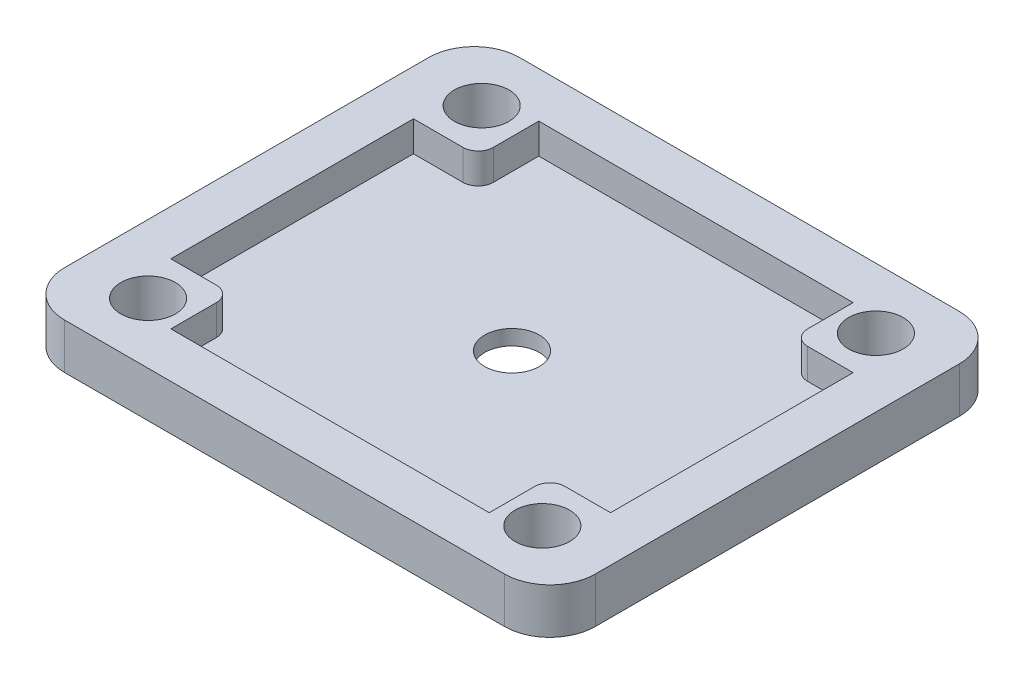
ISO-10303-21;
HEADER;
FILE_DESCRIPTION(('STEP AP214'),'2;1');
FILE_NAME('part.step','',(''),(''),'','','');
FILE_SCHEMA(('AUTOMOTIVE_DESIGN { 1 0 10303 214 1 1 1 1 }'));
ENDSEC;
DATA;
#1=APPLICATION_CONTEXT('core data for automotive mechanical design processes');
#2=APPLICATION_PROTOCOL_DEFINITION('international standard','automotive_design',2000,#1);
#3=PRODUCT_CONTEXT('',#1,'mechanical');
#4=PRODUCT('Part','Part','',(#3));
#5=PRODUCT_RELATED_PRODUCT_CATEGORY('part','',(#4));
#6=PRODUCT_DEFINITION_FORMATION('','',#4);
#7=PRODUCT_DEFINITION_CONTEXT('part definition',#1,'design');
#8=PRODUCT_DEFINITION('design','',#6,#7);
#9=PRODUCT_DEFINITION_SHAPE('','',#8);
#10=(LENGTH_UNIT() NAMED_UNIT(*) SI_UNIT(.MILLI.,.METRE.));
#11=(NAMED_UNIT(*) PLANE_ANGLE_UNIT() SI_UNIT($,.RADIAN.));
#12=(NAMED_UNIT(*) SI_UNIT($,.STERADIAN.) SOLID_ANGLE_UNIT());
#13=UNCERTAINTY_MEASURE_WITH_UNIT(LENGTH_MEASURE(1.E-05),#10,'distance_accuracy_value','');
#14=(GEOMETRIC_REPRESENTATION_CONTEXT(3) GLOBAL_UNCERTAINTY_ASSIGNED_CONTEXT((#13)) GLOBAL_UNIT_ASSIGNED_CONTEXT((#10,
#11,#12)) REPRESENTATION_CONTEXT('',''));
#15=CARTESIAN_POINT('',(0.,0.,0.));
#16=DIRECTION('',(0.,0.,1.));
#17=DIRECTION('',(1.,0.,0.));
#18=AXIS2_PLACEMENT_3D('',#15,#16,#17);
#19=CARTESIAN_POINT('',(0.,3.,0.));
#20=DIRECTION('',(0.,-1.,0.));
#21=DIRECTION('',(0.,0.,-1.));
#22=AXIS2_PLACEMENT_3D('',#19,#20,#21);
#23=PLANE('',#22);
#24=CARTESIAN_POINT('',(13.,3.,-11.));
#25=DIRECTION('',(0.,1.,0.));
#26=DIRECTION('',(0.,0.,1.));
#27=AXIS2_PLACEMENT_3D('',#24,#25,#26);
#28=CIRCLE('',#27,1.79999999999999);
#29=CARTESIAN_POINT('',(13.,3.,-9.20000000000001));
#30=VERTEX_POINT('',#29);
#31=EDGE_CURVE('E752',#30,#30,#28,.T.);
#32=ORIENTED_EDGE('',*,*,#31,.F.);
#33=EDGE_LOOP('',(#32));
#34=FACE_BOUND('',#33,.T.);
#35=CARTESIAN_POINT('',(-13.,3.,11.));
#36=DIRECTION('',(0.,1.,0.));
#37=DIRECTION('',(0.,0.,1.));
#38=AXIS2_PLACEMENT_3D('',#35,#36,#37);
#39=CIRCLE('',#38,1.79999999999999);
#40=CARTESIAN_POINT('',(-13.,3.,12.8));
#41=VERTEX_POINT('',#40);
#42=EDGE_CURVE('E746',#41,#41,#39,.T.);
#43=ORIENTED_EDGE('',*,*,#42,.F.);
#44=EDGE_LOOP('',(#43));
#45=FACE_BOUND('',#44,.T.);
#46=CARTESIAN_POINT('',(-13.,3.,-11.));
#47=DIRECTION('',(0.,1.,0.));
#48=DIRECTION('',(0.,0.,1.));
#49=AXIS2_PLACEMENT_3D('',#46,#47,#48);
#50=CIRCLE('',#49,1.79999999999999);
#51=CARTESIAN_POINT('',(-13.,3.,-9.20000000000001));
#52=VERTEX_POINT('',#51);
#53=EDGE_CURVE('E738',#52,#52,#50,.T.);
#54=ORIENTED_EDGE('',*,*,#53,.F.);
#55=EDGE_LOOP('',(#54));
#56=FACE_BOUND('',#55,.T.);
#57=DIRECTION('',(0.,0.,-1.));
#58=VECTOR('',#57,1.);
#59=CARTESIAN_POINT('',(-10.5,3.,12.));
#60=LINE('',#59,#58);
#61=CARTESIAN_POINT('',(-10.5,3.,12.));
#62=VERTEX_POINT('',#61);
#63=CARTESIAN_POINT('',(-10.5,3.,9.));
#64=VERTEX_POINT('',#63);
#65=EDGE_CURVE('E202',#62,#64,#60,.T.);
#66=ORIENTED_EDGE('',*,*,#65,.T.);
#67=CARTESIAN_POINT('',(-11.5,3.,9.));
#68=DIRECTION('',(0.,-1.,0.));
#69=DIRECTION('',(0.,0.,-1.));
#70=AXIS2_PLACEMENT_3D('',#67,#68,#69);
#71=CIRCLE('',#70,1.);
#72=CARTESIAN_POINT('',(-11.5,3.,8.));
#73=VERTEX_POINT('',#72);
#74=EDGE_CURVE('E369',#64,#73,#71,.F.);
#75=ORIENTED_EDGE('',*,*,#74,.T.);
#76=DIRECTION('',(-1.,0.,0.));
#77=VECTOR('',#76,1.);
#78=CARTESIAN_POINT('',(-14.5,3.,8.00000000000001));
#79=LINE('',#78,#77);
#80=CARTESIAN_POINT('',(-14.5,3.,8.));
#81=VERTEX_POINT('',#80);
#82=EDGE_CURVE('E226',#73,#81,#79,.T.);
#83=ORIENTED_EDGE('',*,*,#82,.T.);
#84=DIRECTION('',(0.,0.,1.));
#85=VECTOR('',#84,1.);
#86=CARTESIAN_POINT('',(-14.5,3.,-12.));
#87=LINE('',#86,#85);
#88=CARTESIAN_POINT('',(-14.5,3.,-7.99999999999999));
#89=VERTEX_POINT('',#88);
#90=EDGE_CURVE('E283',#89,#81,#87,.T.);
#91=ORIENTED_EDGE('',*,*,#90,.F.);
#92=DIRECTION('',(1.,0.,0.));
#93=VECTOR('',#92,1.);
#94=CARTESIAN_POINT('',(-14.5,3.,-7.99999999999999));
#95=LINE('',#94,#93);
#96=CARTESIAN_POINT('',(-11.2337449665981,3.,-7.99999999999999));
#97=VERTEX_POINT('',#96);
#98=EDGE_CURVE('E269',#89,#97,#95,.T.);
#99=ORIENTED_EDGE('',*,*,#98,.T.);
#100=CARTESIAN_POINT('',(-11.2337449665981,3.,-8.99999999999999));
#101=DIRECTION('',(0.,-1.,0.));
#102=DIRECTION('',(0.,0.,-1.));
#103=AXIS2_PLACEMENT_3D('',#100,#101,#102);
#104=CIRCLE('',#103,1.);
#105=CARTESIAN_POINT('',(-10.2337449665981,3.,-8.99999999999999));
#106=VERTEX_POINT('',#105);
#107=EDGE_CURVE('E363',#97,#106,#104,.F.);
#108=ORIENTED_EDGE('',*,*,#107,.T.);
#109=DIRECTION('',(0.,0.,-1.));
#110=VECTOR('',#109,1.);
#111=CARTESIAN_POINT('',(-10.2337449665981,3.,-12.));
#112=LINE('',#111,#110);
#113=CARTESIAN_POINT('',(-10.2337449665981,3.,-12.));
#114=VERTEX_POINT('',#113);
#115=EDGE_CURVE('E272',#106,#114,#112,.T.);
#116=ORIENTED_EDGE('',*,*,#115,.T.);
#117=DIRECTION('',(-1.,0.,0.));
#118=VECTOR('',#117,1.);
#119=CARTESIAN_POINT('',(14.5,3.,-12.));
#120=LINE('',#119,#118);
#121=CARTESIAN_POINT('',(10.5,3.,-12.));
#122=VERTEX_POINT('',#121);
#123=EDGE_CURVE('E295',#122,#114,#120,.T.);
#124=ORIENTED_EDGE('',*,*,#123,.F.);
#125=DIRECTION('',(0.,0.,1.));
#126=VECTOR('',#125,1.);
#127=CARTESIAN_POINT('',(10.5,3.,-12.));
#128=LINE('',#127,#126);
#129=CARTESIAN_POINT('',(10.5,3.,-9.));
#130=VERTEX_POINT('',#129);
#131=EDGE_CURVE('E253',#122,#130,#128,.T.);
#132=ORIENTED_EDGE('',*,*,#131,.T.);
#133=CARTESIAN_POINT('',(11.5,3.,-9.));
#134=DIRECTION('',(0.,-1.,0.));
#135=DIRECTION('',(0.,0.,-1.));
#136=AXIS2_PLACEMENT_3D('',#133,#134,#135);
#137=CIRCLE('',#136,1.);
#138=CARTESIAN_POINT('',(11.5,3.,-8.));
#139=VERTEX_POINT('',#138);
#140=EDGE_CURVE('E365',#130,#139,#137,.F.);
#141=ORIENTED_EDGE('',*,*,#140,.T.);
#142=DIRECTION('',(1.,0.,0.));
#143=VECTOR('',#142,1.);
#144=CARTESIAN_POINT('',(14.5,3.,-8.));
#145=LINE('',#144,#143);
#146=CARTESIAN_POINT('',(14.5,3.,-8.));
#147=VERTEX_POINT('',#146);
#148=EDGE_CURVE('E256',#139,#147,#145,.T.);
#149=ORIENTED_EDGE('',*,*,#148,.T.);
#150=DIRECTION('',(0.,0.,-1.));
#151=VECTOR('',#150,1.);
#152=CARTESIAN_POINT('',(14.5,3.,12.));
#153=LINE('',#152,#151);
#154=CARTESIAN_POINT('',(14.5,3.,8.));
#155=VERTEX_POINT('',#154);
#156=EDGE_CURVE('E209',#155,#147,#153,.T.);
#157=ORIENTED_EDGE('',*,*,#156,.F.);
#158=DIRECTION('',(-1.,0.,0.));
#159=VECTOR('',#158,1.);
#160=CARTESIAN_POINT('',(14.5,3.,8.));
#161=LINE('',#160,#159);
#162=CARTESIAN_POINT('',(11.5,3.,8.));
#163=VERTEX_POINT('',#162);
#164=EDGE_CURVE('E239',#155,#163,#161,.T.);
#165=ORIENTED_EDGE('',*,*,#164,.T.);
#166=CARTESIAN_POINT('',(11.5,3.,9.));
#167=DIRECTION('',(0.,-1.,0.));
#168=DIRECTION('',(0.,0.,-1.));
#169=AXIS2_PLACEMENT_3D('',#166,#167,#168);
#170=CIRCLE('',#169,1.);
#171=CARTESIAN_POINT('',(10.5,3.,9.));
#172=VERTEX_POINT('',#171);
#173=EDGE_CURVE('E367',#163,#172,#170,.F.);
#174=ORIENTED_EDGE('',*,*,#173,.T.);
#175=DIRECTION('',(0.,0.,1.));
#176=VECTOR('',#175,1.);
#177=CARTESIAN_POINT('',(10.5,3.,12.));
#178=LINE('',#177,#176);
#179=CARTESIAN_POINT('',(10.5,3.,12.));
#180=VERTEX_POINT('',#179);
#181=EDGE_CURVE('E205',#172,#180,#178,.T.);
#182=ORIENTED_EDGE('',*,*,#181,.T.);
#183=DIRECTION('',(1.,0.,0.));
#184=VECTOR('',#183,1.);
#185=CARTESIAN_POINT('',(-14.5,3.,12.));
#186=LINE('',#185,#184);
#187=EDGE_CURVE('E198',#62,#180,#186,.T.);
#188=ORIENTED_EDGE('',*,*,#187,.F.);
#189=EDGE_LOOP('',(#66,#75,#83,#91,#99,#108,#116,#124,#132,#141,#149,#157,#165,#174,#182,#188));
#190=FACE_BOUND('',#189,.T.);
#191=DIRECTION('',(1.,0.,0.));
#192=VECTOR('',#191,1.);
#193=CARTESIAN_POINT('',(-17.5,3.,15.));
#194=LINE('',#193,#192);
#195=CARTESIAN_POINT('',(-14.5,3.,15.));
#196=VERTEX_POINT('',#195);
#197=CARTESIAN_POINT('',(14.5,3.,15.));
#198=VERTEX_POINT('',#197);
#199=EDGE_CURVE('E310',#196,#198,#194,.T.);
#200=ORIENTED_EDGE('',*,*,#199,.T.);
#201=CARTESIAN_POINT('',(14.5,3.,12.));
#202=DIRECTION('',(0.,-1.,0.));
#203=DIRECTION('',(0.,0.,-1.));
#204=AXIS2_PLACEMENT_3D('',#201,#202,#203);
#205=CIRCLE('',#204,3.);
#206=CARTESIAN_POINT('',(17.5,3.,12.));
#207=VERTEX_POINT('',#206);
#208=EDGE_CURVE('E347',#198,#207,#205,.F.);
#209=ORIENTED_EDGE('',*,*,#208,.T.);
#210=DIRECTION('',(0.,0.,-1.));
#211=VECTOR('',#210,1.);
#212=CARTESIAN_POINT('',(17.5,3.,15.));
#213=LINE('',#212,#211);
#214=CARTESIAN_POINT('',(17.5,3.,-12.));
#215=VERTEX_POINT('',#214);
#216=EDGE_CURVE('E300',#207,#215,#213,.T.);
#217=ORIENTED_EDGE('',*,*,#216,.T.);
#218=CARTESIAN_POINT('',(14.5,3.,-12.));
#219=DIRECTION('',(0.,-1.,0.));
#220=DIRECTION('',(0.,0.,-1.));
#221=AXIS2_PLACEMENT_3D('',#218,#219,#220);
#222=CIRCLE('',#221,3.);
#223=CARTESIAN_POINT('',(14.5,3.,-15.));
#224=VERTEX_POINT('',#223);
#225=EDGE_CURVE('E341',#215,#224,#222,.F.);
#226=ORIENTED_EDGE('',*,*,#225,.T.);
#227=DIRECTION('',(-1.,0.,0.));
#228=VECTOR('',#227,1.);
#229=CARTESIAN_POINT('',(-17.5,3.,-15.));
#230=LINE('',#229,#228);
#231=CARTESIAN_POINT('',(-14.5,3.,-15.));
#232=VERTEX_POINT('',#231);
#233=EDGE_CURVE('E303',#224,#232,#230,.T.);
#234=ORIENTED_EDGE('',*,*,#233,.T.);
#235=CARTESIAN_POINT('',(-14.5,3.,-12.));
#236=DIRECTION('',(0.,-1.,0.));
#237=DIRECTION('',(0.,0.,-1.));
#238=AXIS2_PLACEMENT_3D('',#235,#236,#237);
#239=CIRCLE('',#238,3.);
#240=CARTESIAN_POINT('',(-17.5,3.,-12.));
#241=VERTEX_POINT('',#240);
#242=EDGE_CURVE('E343',#232,#241,#239,.F.);
#243=ORIENTED_EDGE('',*,*,#242,.T.);
#244=DIRECTION('',(0.,0.,1.));
#245=VECTOR('',#244,1.);
#246=CARTESIAN_POINT('',(-17.5,3.,15.));
#247=LINE('',#246,#245);
#248=CARTESIAN_POINT('',(-17.5,3.,12.));
#249=VERTEX_POINT('',#248);
#250=EDGE_CURVE('E307',#241,#249,#247,.T.);
#251=ORIENTED_EDGE('',*,*,#250,.T.);
#252=CARTESIAN_POINT('',(-14.5,3.,12.));
#253=DIRECTION('',(0.,-1.,0.));
#254=DIRECTION('',(0.,0.,-1.));
#255=AXIS2_PLACEMENT_3D('',#252,#253,#254);
#256=CIRCLE('',#255,3.);
#257=EDGE_CURVE('E345',#249,#196,#256,.F.);
#258=ORIENTED_EDGE('',*,*,#257,.T.);
#259=EDGE_LOOP('',(#200,#209,#217,#226,#234,#243,#251,#258));
#260=FACE_BOUND('',#259,.T.);
#261=CARTESIAN_POINT('',(13.,3.,11.));
#262=DIRECTION('',(0.,1.,0.));
#263=DIRECTION('',(0.,0.,1.));
#264=AXIS2_PLACEMENT_3D('',#261,#262,#263);
#265=CIRCLE('',#264,1.79999999999999);
#266=CARTESIAN_POINT('',(13.,3.,12.8));
#267=VERTEX_POINT('',#266);
#268=EDGE_CURVE('E734',#267,#267,#265,.T.);
#269=ORIENTED_EDGE('',*,*,#268,.F.);
#270=EDGE_LOOP('',(#269));
#271=FACE_BOUND('',#270,.T.);
#272=ADVANCED_FACE('F38',(#34,#45,#56,#190,#260,#271),#23,.F.);
#273=CARTESIAN_POINT('',(0.,1.,0.));
#274=DIRECTION('',(0.,1.,0.));
#275=DIRECTION('',(0.,0.,1.));
#276=AXIS2_PLACEMENT_3D('',#273,#274,#275);
#277=PLANE('',#276);
#278=CARTESIAN_POINT('',(0.,1.,0.));
#279=DIRECTION('',(0.,1.,0.));
#280=DIRECTION('',(0.,0.,1.));
#281=AXIS2_PLACEMENT_3D('',#278,#279,#280);
#282=CIRCLE('',#281,1.79999999999999);
#283=CARTESIAN_POINT('',(0.,1.,1.79999999999999));
#284=VERTEX_POINT('',#283);
#285=EDGE_CURVE('E755',#284,#284,#282,.T.);
#286=ORIENTED_EDGE('',*,*,#285,.F.);
#287=EDGE_LOOP('',(#286));
#288=FACE_BOUND('',#287,.T.);
#289=DIRECTION('',(-1.,0.,0.));
#290=VECTOR('',#289,1.);
#291=CARTESIAN_POINT('',(-14.5,1.,8.00000000000001));
#292=LINE('',#291,#290);
#293=CARTESIAN_POINT('',(-11.5,1.,8.));
#294=VERTEX_POINT('',#293);
#295=CARTESIAN_POINT('',(-14.5,1.,8.));
#296=VERTEX_POINT('',#295);
#297=EDGE_CURVE('E227',#294,#296,#292,.T.);
#298=ORIENTED_EDGE('',*,*,#297,.F.);
#299=CARTESIAN_POINT('',(-11.5,1.,9.));
#300=DIRECTION('',(0.,1.,0.));
#301=DIRECTION('',(0.,0.,1.));
#302=AXIS2_PLACEMENT_3D('',#299,#300,#301);
#303=CIRCLE('',#302,1.);
#304=CARTESIAN_POINT('',(-10.5,1.,9.));
#305=VERTEX_POINT('',#304);
#306=EDGE_CURVE('E385',#294,#305,#303,.F.);
#307=ORIENTED_EDGE('',*,*,#306,.T.);
#308=DIRECTION('',(0.,0.,-1.));
#309=VECTOR('',#308,1.);
#310=CARTESIAN_POINT('',(-10.5,1.,12.));
#311=LINE('',#310,#309);
#312=CARTESIAN_POINT('',(-10.5,1.,12.));
#313=VERTEX_POINT('',#312);
#314=EDGE_CURVE('E230',#313,#305,#311,.T.);
#315=ORIENTED_EDGE('',*,*,#314,.F.);
#316=DIRECTION('',(1.,0.,0.));
#317=VECTOR('',#316,1.);
#318=CARTESIAN_POINT('',(-14.5,1.,12.));
#319=LINE('',#318,#317);
#320=CARTESIAN_POINT('',(10.5,1.,12.));
#321=VERTEX_POINT('',#320);
#322=EDGE_CURVE('E217',#313,#321,#319,.T.);
#323=ORIENTED_EDGE('',*,*,#322,.T.);
#324=DIRECTION('',(0.,0.,1.));
#325=VECTOR('',#324,1.);
#326=CARTESIAN_POINT('',(10.5,1.,12.));
#327=LINE('',#326,#325);
#328=CARTESIAN_POINT('',(10.5,1.,9.));
#329=VERTEX_POINT('',#328);
#330=EDGE_CURVE('E242',#329,#321,#327,.T.);
#331=ORIENTED_EDGE('',*,*,#330,.F.);
#332=CARTESIAN_POINT('',(11.5,1.,9.));
#333=DIRECTION('',(0.,1.,0.));
#334=DIRECTION('',(0.,0.,1.));
#335=AXIS2_PLACEMENT_3D('',#332,#333,#334);
#336=CIRCLE('',#335,1.);
#337=CARTESIAN_POINT('',(11.5,1.,8.));
#338=VERTEX_POINT('',#337);
#339=EDGE_CURVE('E387',#329,#338,#336,.F.);
#340=ORIENTED_EDGE('',*,*,#339,.T.);
#341=DIRECTION('',(-1.,0.,0.));
#342=VECTOR('',#341,1.);
#343=CARTESIAN_POINT('',(14.5,1.,8.));
#344=LINE('',#343,#342);
#345=CARTESIAN_POINT('',(14.5,1.,8.));
#346=VERTEX_POINT('',#345);
#347=EDGE_CURVE('E220',#346,#338,#344,.T.);
#348=ORIENTED_EDGE('',*,*,#347,.F.);
#349=DIRECTION('',(0.,0.,-1.));
#350=VECTOR('',#349,1.);
#351=CARTESIAN_POINT('',(14.5,1.,12.));
#352=LINE('',#351,#350);
#353=CARTESIAN_POINT('',(14.5,1.,-8.));
#354=VERTEX_POINT('',#353);
#355=EDGE_CURVE('E282',#346,#354,#352,.T.);
#356=ORIENTED_EDGE('',*,*,#355,.T.);
#357=DIRECTION('',(1.,0.,0.));
#358=VECTOR('',#357,1.);
#359=CARTESIAN_POINT('',(14.5,1.,-8.));
#360=LINE('',#359,#358);
#361=CARTESIAN_POINT('',(11.5,1.,-8.));
#362=VERTEX_POINT('',#361);
#363=EDGE_CURVE('E257',#362,#354,#360,.T.);
#364=ORIENTED_EDGE('',*,*,#363,.F.);
#365=CARTESIAN_POINT('',(11.5,1.,-9.));
#366=DIRECTION('',(0.,1.,0.));
#367=DIRECTION('',(0.,0.,1.));
#368=AXIS2_PLACEMENT_3D('',#365,#366,#367);
#369=CIRCLE('',#368,1.);
#370=CARTESIAN_POINT('',(10.5,1.,-9.));
#371=VERTEX_POINT('',#370);
#372=EDGE_CURVE('E46',#362,#371,#369,.F.);
#373=ORIENTED_EDGE('',*,*,#372,.T.);
#374=DIRECTION('',(0.,0.,1.));
#375=VECTOR('',#374,1.);
#376=CARTESIAN_POINT('',(10.5,1.,-12.));
#377=LINE('',#376,#375);
#378=CARTESIAN_POINT('',(10.5,1.,-12.));
#379=VERTEX_POINT('',#378);
#380=EDGE_CURVE('E252',#379,#371,#377,.T.);
#381=ORIENTED_EDGE('',*,*,#380,.F.);
#382=DIRECTION('',(-1.,0.,0.));
#383=VECTOR('',#382,1.);
#384=CARTESIAN_POINT('',(14.5,1.,-12.));
#385=LINE('',#384,#383);
#386=CARTESIAN_POINT('',(-10.2337449665981,1.,-12.));
#387=VERTEX_POINT('',#386);
#388=EDGE_CURVE('E286',#379,#387,#385,.T.);
#389=ORIENTED_EDGE('',*,*,#388,.T.);
#390=DIRECTION('',(0.,0.,-1.));
#391=VECTOR('',#390,1.);
#392=CARTESIAN_POINT('',(-10.2337449665981,1.,-12.));
#393=LINE('',#392,#391);
#394=CARTESIAN_POINT('',(-10.2337449665981,1.,-8.99999999999999));
#395=VERTEX_POINT('',#394);
#396=EDGE_CURVE('E273',#395,#387,#393,.T.);
#397=ORIENTED_EDGE('',*,*,#396,.F.);
#398=CARTESIAN_POINT('',(-11.2337449665981,1.,-8.99999999999999));
#399=DIRECTION('',(0.,1.,0.));
#400=DIRECTION('',(0.,0.,1.));
#401=AXIS2_PLACEMENT_3D('',#398,#399,#400);
#402=CIRCLE('',#401,1.);
#403=CARTESIAN_POINT('',(-11.2337449665981,1.,-7.99999999999999));
#404=VERTEX_POINT('',#403);
#405=EDGE_CURVE('E11',#395,#404,#402,.F.);
#406=ORIENTED_EDGE('',*,*,#405,.T.);
#407=DIRECTION('',(1.,0.,0.));
#408=VECTOR('',#407,1.);
#409=CARTESIAN_POINT('',(-14.5,1.,-7.99999999999999));
#410=LINE('',#409,#408);
#411=CARTESIAN_POINT('',(-14.5,1.,-7.99999999999999));
#412=VERTEX_POINT('',#411);
#413=EDGE_CURVE('E268',#412,#404,#410,.T.);
#414=ORIENTED_EDGE('',*,*,#413,.F.);
#415=DIRECTION('',(0.,0.,1.));
#416=VECTOR('',#415,1.);
#417=CARTESIAN_POINT('',(-14.5,1.,-12.));
#418=LINE('',#417,#416);
#419=EDGE_CURVE('E289',#412,#296,#418,.T.);
#420=ORIENTED_EDGE('',*,*,#419,.T.);
#421=EDGE_LOOP('',(#298,#307,#315,#323,#331,#340,#348,#356,#364,#373,#381,#389,#397,#406,#414,#420));
#422=FACE_BOUND('',#421,.T.);
#423=ADVANCED_FACE('F390',(#288,#422),#277,.T.);
#424=CARTESIAN_POINT('',(-14.5,1.,12.));
#425=DIRECTION('',(0.,0.,1.));
#426=DIRECTION('',(1.,0.,0.));
#427=AXIS2_PLACEMENT_3D('',#424,#425,#426);
#428=PLANE('',#427);
#429=DIRECTION('',(0.,-1.,0.));
#430=VECTOR('',#429,1.);
#431=CARTESIAN_POINT('',(-10.5,3.,12.));
#432=LINE('',#431,#430);
#433=EDGE_CURVE('E214',#62,#313,#432,.T.);
#434=ORIENTED_EDGE('',*,*,#433,.F.);
#435=ORIENTED_EDGE('',*,*,#187,.T.);
#436=DIRECTION('',(0.,-1.,0.));
#437=VECTOR('',#436,1.);
#438=CARTESIAN_POINT('',(10.5,3.,12.));
#439=LINE('',#438,#437);
#440=EDGE_CURVE('E244',#180,#321,#439,.T.);
#441=ORIENTED_EDGE('',*,*,#440,.T.);
#442=ORIENTED_EDGE('',*,*,#322,.F.);
#443=EDGE_LOOP('',(#434,#435,#441,#442));
#444=FACE_BOUND('',#443,.T.);
#445=ADVANCED_FACE('F215',(#444),#428,.F.);
#446=CARTESIAN_POINT('',(-14.5,1.,-12.));
#447=DIRECTION('',(-1.,0.,0.));
#448=DIRECTION('',(0.,0.,1.));
#449=AXIS2_PLACEMENT_3D('',#446,#447,#448);
#450=PLANE('',#449);
#451=DIRECTION('',(0.,-1.,0.));
#452=VECTOR('',#451,1.);
#453=CARTESIAN_POINT('',(-14.5,3.,8.00000000000001));
#454=LINE('',#453,#452);
#455=EDGE_CURVE('E221',#81,#296,#454,.T.);
#456=ORIENTED_EDGE('',*,*,#455,.T.);
#457=ORIENTED_EDGE('',*,*,#419,.F.);
#458=DIRECTION('',(0.,-1.,0.));
#459=VECTOR('',#458,1.);
#460=CARTESIAN_POINT('',(-14.5,3.,-7.99999999999999));
#461=LINE('',#460,#459);
#462=EDGE_CURVE('E210',#89,#412,#461,.T.);
#463=ORIENTED_EDGE('',*,*,#462,.F.);
#464=ORIENTED_EDGE('',*,*,#90,.T.);
#465=EDGE_LOOP('',(#456,#457,#463,#464));
#466=FACE_BOUND('',#465,.T.);
#467=ADVANCED_FACE('F430',(#466),#450,.F.);
#468=CARTESIAN_POINT('',(14.5,1.,12.));
#469=DIRECTION('',(1.,0.,0.));
#470=DIRECTION('',(0.,0.,-1.));
#471=AXIS2_PLACEMENT_3D('',#468,#469,#470);
#472=PLANE('',#471);
#473=DIRECTION('',(0.,-1.,0.));
#474=VECTOR('',#473,1.);
#475=CARTESIAN_POINT('',(14.5,3.,8.));
#476=LINE('',#475,#474);
#477=EDGE_CURVE('E249',#155,#346,#476,.T.);
#478=ORIENTED_EDGE('',*,*,#477,.F.);
#479=ORIENTED_EDGE('',*,*,#156,.T.);
#480=DIRECTION('',(0.,-1.,0.));
#481=VECTOR('',#480,1.);
#482=CARTESIAN_POINT('',(14.5,3.,-8.));
#483=LINE('',#482,#481);
#484=EDGE_CURVE('E259',#147,#354,#483,.T.);
#485=ORIENTED_EDGE('',*,*,#484,.T.);
#486=ORIENTED_EDGE('',*,*,#355,.F.);
#487=EDGE_LOOP('',(#478,#479,#485,#486));
#488=FACE_BOUND('',#487,.T.);
#489=ADVANCED_FACE('F408',(#488),#472,.F.);
#490=CARTESIAN_POINT('',(14.5,1.,-12.));
#491=DIRECTION('',(0.,0.,-1.));
#492=DIRECTION('',(-1.,0.,0.));
#493=AXIS2_PLACEMENT_3D('',#490,#491,#492);
#494=PLANE('',#493);
#495=DIRECTION('',(0.,-1.,0.));
#496=VECTOR('',#495,1.);
#497=CARTESIAN_POINT('',(10.5,3.,-12.));
#498=LINE('',#497,#496);
#499=EDGE_CURVE('E265',#122,#379,#498,.T.);
#500=ORIENTED_EDGE('',*,*,#499,.F.);
#501=ORIENTED_EDGE('',*,*,#123,.T.);
#502=DIRECTION('',(0.,-1.,0.));
#503=VECTOR('',#502,1.);
#504=CARTESIAN_POINT('',(-10.2337449665981,3.,-12.));
#505=LINE('',#504,#503);
#506=EDGE_CURVE('E275',#114,#387,#505,.T.);
#507=ORIENTED_EDGE('',*,*,#506,.T.);
#508=ORIENTED_EDGE('',*,*,#388,.F.);
#509=EDGE_LOOP('',(#500,#501,#507,#508));
#510=FACE_BOUND('',#509,.T.);
#511=ADVANCED_FACE('F440',(#510),#494,.F.);
#512=CARTESIAN_POINT('',(17.5,3.,15.));
#513=DIRECTION('',(-1.,0.,0.));
#514=DIRECTION('',(0.,0.,1.));
#515=AXIS2_PLACEMENT_3D('',#512,#513,#514);
#516=PLANE('',#515);
#517=ORIENTED_EDGE('',*,*,#216,.F.);
#518=DIRECTION('',(0.,-1.,0.));
#519=VECTOR('',#518,1.);
#520=CARTESIAN_POINT('',(17.5,3.,12.));
#521=LINE('',#520,#519);
#522=CARTESIAN_POINT('',(17.5,0.,12.));
#523=VERTEX_POINT('',#522);
#524=EDGE_CURVE('E325',#207,#523,#521,.T.);
#525=ORIENTED_EDGE('',*,*,#524,.T.);
#526=DIRECTION('',(0.,0.,-1.));
#527=VECTOR('',#526,1.);
#528=CARTESIAN_POINT('',(17.5,0.,15.));
#529=LINE('',#528,#527);
#530=CARTESIAN_POINT('',(17.5,0.,-12.));
#531=VERTEX_POINT('',#530);
#532=EDGE_CURVE('E291',#523,#531,#529,.T.);
#533=ORIENTED_EDGE('',*,*,#532,.T.);
#534=DIRECTION('',(0.,-1.,0.));
#535=VECTOR('',#534,1.);
#536=CARTESIAN_POINT('',(17.5,3.,-12.));
#537=LINE('',#536,#535);
#538=EDGE_CURVE('E313',#531,#215,#537,.F.);
#539=ORIENTED_EDGE('',*,*,#538,.T.);
#540=EDGE_LOOP('',(#517,#525,#533,#539));
#541=FACE_BOUND('',#540,.T.);
#542=ADVANCED_FACE('F442',(#541),#516,.F.);
#543=CARTESIAN_POINT('',(-17.5,3.,-15.));
#544=DIRECTION('',(0.,0.,1.));
#545=DIRECTION('',(1.,0.,0.));
#546=AXIS2_PLACEMENT_3D('',#543,#544,#545);
#547=PLANE('',#546);
#548=DIRECTION('',(-1.,0.,0.));
#549=VECTOR('',#548,1.);
#550=CARTESIAN_POINT('',(-17.5,0.,-15.));
#551=LINE('',#550,#549);
#552=CARTESIAN_POINT('',(14.5,0.,-15.));
#553=VERTEX_POINT('',#552);
#554=CARTESIAN_POINT('',(-14.5,0.,-15.));
#555=VERTEX_POINT('',#554);
#556=EDGE_CURVE('E316',#553,#555,#551,.T.);
#557=ORIENTED_EDGE('',*,*,#556,.T.);
#558=DIRECTION('',(0.,-1.,0.));
#559=VECTOR('',#558,1.);
#560=CARTESIAN_POINT('',(-14.5,3.,-15.));
#561=LINE('',#560,#559);
#562=EDGE_CURVE('E357',#555,#232,#561,.F.);
#563=ORIENTED_EDGE('',*,*,#562,.T.);
#564=ORIENTED_EDGE('',*,*,#233,.F.);
#565=DIRECTION('',(0.,-1.,0.));
#566=VECTOR('',#565,1.);
#567=CARTESIAN_POINT('',(14.5,3.,-15.));
#568=LINE('',#567,#566);
#569=EDGE_CURVE('E354',#224,#553,#568,.T.);
#570=ORIENTED_EDGE('',*,*,#569,.T.);
#571=EDGE_LOOP('',(#557,#563,#564,#570));
#572=FACE_BOUND('',#571,.T.);
#573=ADVANCED_FACE('F448',(#572),#547,.F.);
#574=CARTESIAN_POINT('',(-17.5,3.,15.));
#575=DIRECTION('',(1.,0.,0.));
#576=DIRECTION('',(0.,0.,-1.));
#577=AXIS2_PLACEMENT_3D('',#574,#575,#576);
#578=PLANE('',#577);
#579=DIRECTION('',(0.,0.,1.));
#580=VECTOR('',#579,1.);
#581=CARTESIAN_POINT('',(-17.5,0.,15.));
#582=LINE('',#581,#580);
#583=CARTESIAN_POINT('',(-17.5,0.,-12.));
#584=VERTEX_POINT('',#583);
#585=CARTESIAN_POINT('',(-17.5,0.,12.));
#586=VERTEX_POINT('',#585);
#587=EDGE_CURVE('E319',#584,#586,#582,.T.);
#588=ORIENTED_EDGE('',*,*,#587,.T.);
#589=DIRECTION('',(0.,-1.,0.));
#590=VECTOR('',#589,1.);
#591=CARTESIAN_POINT('',(-17.5,3.,12.));
#592=LINE('',#591,#590);
#593=EDGE_CURVE('E352',#586,#249,#592,.F.);
#594=ORIENTED_EDGE('',*,*,#593,.T.);
#595=ORIENTED_EDGE('',*,*,#250,.F.);
#596=DIRECTION('',(0.,-1.,0.));
#597=VECTOR('',#596,1.);
#598=CARTESIAN_POINT('',(-17.5,3.,-12.));
#599=LINE('',#598,#597);
#600=EDGE_CURVE('E349',#241,#584,#599,.T.);
#601=ORIENTED_EDGE('',*,*,#600,.T.);
#602=EDGE_LOOP('',(#588,#594,#595,#601));
#603=FACE_BOUND('',#602,.T.);
#604=ADVANCED_FACE('F472',(#603),#578,.F.);
#605=CARTESIAN_POINT('',(-17.5,3.,15.));
#606=DIRECTION('',(0.,0.,-1.));
#607=DIRECTION('',(-1.,0.,0.));
#608=AXIS2_PLACEMENT_3D('',#605,#606,#607);
#609=PLANE('',#608);
#610=DIRECTION('',(1.,0.,0.));
#611=VECTOR('',#610,1.);
#612=CARTESIAN_POINT('',(-17.5,0.,15.));
#613=LINE('',#612,#611);
#614=CARTESIAN_POINT('',(-14.5,0.,15.));
#615=VERTEX_POINT('',#614);
#616=CARTESIAN_POINT('',(14.5,0.,15.));
#617=VERTEX_POINT('',#616);
#618=EDGE_CURVE('E304',#615,#617,#613,.T.);
#619=ORIENTED_EDGE('',*,*,#618,.T.);
#620=DIRECTION('',(0.,-1.,0.));
#621=VECTOR('',#620,1.);
#622=CARTESIAN_POINT('',(14.5,3.,15.));
#623=LINE('',#622,#621);
#624=EDGE_CURVE('E339',#617,#198,#623,.F.);
#625=ORIENTED_EDGE('',*,*,#624,.T.);
#626=ORIENTED_EDGE('',*,*,#199,.F.);
#627=DIRECTION('',(0.,-1.,0.));
#628=VECTOR('',#627,1.);
#629=CARTESIAN_POINT('',(-14.5,3.,15.));
#630=LINE('',#629,#628);
#631=EDGE_CURVE('E336',#196,#615,#630,.T.);
#632=ORIENTED_EDGE('',*,*,#631,.T.);
#633=EDGE_LOOP('',(#619,#625,#626,#632));
#634=FACE_BOUND('',#633,.T.);
#635=ADVANCED_FACE('F468',(#634),#609,.F.);
#636=CARTESIAN_POINT('',(0.,0.,0.));
#637=DIRECTION('',(0.,-1.,0.));
#638=DIRECTION('',(0.,0.,-1.));
#639=AXIS2_PLACEMENT_3D('',#636,#637,#638);
#640=PLANE('',#639);
#641=CARTESIAN_POINT('',(0.,0.,0.));
#642=DIRECTION('',(0.,1.,0.));
#643=DIRECTION('',(0.,0.,1.));
#644=AXIS2_PLACEMENT_3D('',#641,#642,#643);
#645=CIRCLE('',#644,1.8);
#646=CARTESIAN_POINT('',(0.,0.,1.8));
#647=VERTEX_POINT('',#646);
#648=EDGE_CURVE('E758',#647,#647,#645,.T.);
#649=ORIENTED_EDGE('',*,*,#648,.T.);
#650=EDGE_LOOP('',(#649));
#651=FACE_BOUND('',#650,.T.);
#652=CARTESIAN_POINT('',(13.,0.,-11.));
#653=DIRECTION('',(0.,1.,0.));
#654=DIRECTION('',(0.,0.,1.));
#655=AXIS2_PLACEMENT_3D('',#652,#653,#654);
#656=CIRCLE('',#655,1.8);
#657=CARTESIAN_POINT('',(13.,0.,-9.2));
#658=VERTEX_POINT('',#657);
#659=EDGE_CURVE('E749',#658,#658,#656,.T.);
#660=ORIENTED_EDGE('',*,*,#659,.T.);
#661=EDGE_LOOP('',(#660));
#662=FACE_BOUND('',#661,.T.);
#663=CARTESIAN_POINT('',(-13.,0.,11.));
#664=DIRECTION('',(0.,1.,0.));
#665=DIRECTION('',(0.,0.,1.));
#666=AXIS2_PLACEMENT_3D('',#663,#664,#665);
#667=CIRCLE('',#666,1.8);
#668=CARTESIAN_POINT('',(-13.,0.,12.8));
#669=VERTEX_POINT('',#668);
#670=EDGE_CURVE('E743',#669,#669,#667,.T.);
#671=ORIENTED_EDGE('',*,*,#670,.T.);
#672=EDGE_LOOP('',(#671));
#673=FACE_BOUND('',#672,.T.);
#674=CARTESIAN_POINT('',(-13.,0.,-11.));
#675=DIRECTION('',(0.,1.,0.));
#676=DIRECTION('',(0.,0.,1.));
#677=AXIS2_PLACEMENT_3D('',#674,#675,#676);
#678=CIRCLE('',#677,1.8);
#679=CARTESIAN_POINT('',(-13.,0.,-9.2));
#680=VERTEX_POINT('',#679);
#681=EDGE_CURVE('E736',#680,#680,#678,.T.);
#682=ORIENTED_EDGE('',*,*,#681,.T.);
#683=EDGE_LOOP('',(#682));
#684=FACE_BOUND('',#683,.T.);
#685=CARTESIAN_POINT('',(13.,0.,11.));
#686=DIRECTION('',(0.,1.,0.));
#687=DIRECTION('',(0.,0.,1.));
#688=AXIS2_PLACEMENT_3D('',#685,#686,#687);
#689=CIRCLE('',#688,1.8);
#690=CARTESIAN_POINT('',(13.,0.,12.8));
#691=VERTEX_POINT('',#690);
#692=EDGE_CURVE('E233',#691,#691,#689,.T.);
#693=ORIENTED_EDGE('',*,*,#692,.T.);
#694=EDGE_LOOP('',(#693));
#695=FACE_BOUND('',#694,.T.);
#696=ORIENTED_EDGE('',*,*,#532,.F.);
#697=CARTESIAN_POINT('',(14.5,0.,12.));
#698=DIRECTION('',(0.,-1.,0.));
#699=DIRECTION('',(0.,0.,-1.));
#700=AXIS2_PLACEMENT_3D('',#697,#698,#699);
#701=CIRCLE('',#700,3.);
#702=EDGE_CURVE('E334',#523,#617,#701,.T.);
#703=ORIENTED_EDGE('',*,*,#702,.T.);
#704=ORIENTED_EDGE('',*,*,#618,.F.);
#705=CARTESIAN_POINT('',(-14.5,0.,12.));
#706=DIRECTION('',(0.,-1.,0.));
#707=DIRECTION('',(0.,0.,-1.));
#708=AXIS2_PLACEMENT_3D('',#705,#706,#707);
#709=CIRCLE('',#708,3.);
#710=EDGE_CURVE('E332',#615,#586,#709,.T.);
#711=ORIENTED_EDGE('',*,*,#710,.T.);
#712=ORIENTED_EDGE('',*,*,#587,.F.);
#713=CARTESIAN_POINT('',(-14.5,0.,-12.));
#714=DIRECTION('',(0.,-1.,0.));
#715=DIRECTION('',(0.,0.,-1.));
#716=AXIS2_PLACEMENT_3D('',#713,#714,#715);
#717=CIRCLE('',#716,3.);
#718=EDGE_CURVE('E330',#584,#555,#717,.T.);
#719=ORIENTED_EDGE('',*,*,#718,.T.);
#720=ORIENTED_EDGE('',*,*,#556,.F.);
#721=CARTESIAN_POINT('',(14.5,0.,-12.));
#722=DIRECTION('',(0.,-1.,0.));
#723=DIRECTION('',(0.,0.,-1.));
#724=AXIS2_PLACEMENT_3D('',#721,#722,#723);
#725=CIRCLE('',#724,3.);
#726=EDGE_CURVE('E328',#553,#531,#725,.T.);
#727=ORIENTED_EDGE('',*,*,#726,.T.);
#728=EDGE_LOOP('',(#696,#703,#704,#711,#712,#719,#720,#727));
#729=FACE_BOUND('',#728,.T.);
#730=ADVANCED_FACE('F465',(#651,#662,#673,#684,#695,#729),#640,.T.);
#731=CARTESIAN_POINT('',(-14.5,3.,-7.99999999999999));
#732=DIRECTION('',(0.,0.,-1.));
#733=DIRECTION('',(-1.,0.,0.));
#734=AXIS2_PLACEMENT_3D('',#731,#732,#733);
#735=PLANE('',#734);
#736=ORIENTED_EDGE('',*,*,#413,.T.);
#737=DIRECTION('',(0.,-1.,0.));
#738=VECTOR('',#737,1.);
#739=CARTESIAN_POINT('',(-11.2337449665981,3.,-7.99999999999999));
#740=LINE('',#739,#738);
#741=EDGE_CURVE('E383',#404,#97,#740,.F.);
#742=ORIENTED_EDGE('',*,*,#741,.T.);
#743=ORIENTED_EDGE('',*,*,#98,.F.);
#744=ORIENTED_EDGE('',*,*,#462,.T.);
#745=EDGE_LOOP('',(#736,#742,#743,#744));
#746=FACE_BOUND('',#745,.T.);
#747=ADVANCED_FACE('F433',(#746),#735,.F.);
#748=CARTESIAN_POINT('',(-10.2337449665981,3.,-12.));
#749=DIRECTION('',(-1.,0.,0.));
#750=DIRECTION('',(0.,0.,1.));
#751=AXIS2_PLACEMENT_3D('',#748,#749,#750);
#752=PLANE('',#751);
#753=ORIENTED_EDGE('',*,*,#115,.F.);
#754=DIRECTION('',(0.,-1.,0.));
#755=VECTOR('',#754,1.);
#756=CARTESIAN_POINT('',(-10.2337449665981,3.,-8.99999999999999));
#757=LINE('',#756,#755);
#758=EDGE_CURVE('E381',#106,#395,#757,.T.);
#759=ORIENTED_EDGE('',*,*,#758,.T.);
#760=ORIENTED_EDGE('',*,*,#396,.T.);
#761=ORIENTED_EDGE('',*,*,#506,.F.);
#762=EDGE_LOOP('',(#753,#759,#760,#761));
#763=FACE_BOUND('',#762,.T.);
#764=ADVANCED_FACE('F438',(#763),#752,.F.);
#765=CARTESIAN_POINT('',(10.5,3.,-12.));
#766=DIRECTION('',(1.,0.,0.));
#767=DIRECTION('',(0.,0.,-1.));
#768=AXIS2_PLACEMENT_3D('',#765,#766,#767);
#769=PLANE('',#768);
#770=ORIENTED_EDGE('',*,*,#380,.T.);
#771=DIRECTION('',(0.,-1.,0.));
#772=VECTOR('',#771,1.);
#773=CARTESIAN_POINT('',(10.5,3.,-9.));
#774=LINE('',#773,#772);
#775=EDGE_CURVE('E379',#371,#130,#774,.F.);
#776=ORIENTED_EDGE('',*,*,#775,.T.);
#777=ORIENTED_EDGE('',*,*,#131,.F.);
#778=ORIENTED_EDGE('',*,*,#499,.T.);
#779=EDGE_LOOP('',(#770,#776,#777,#778));
#780=FACE_BOUND('',#779,.T.);
#781=ADVANCED_FACE('F396',(#780),#769,.F.);
#782=CARTESIAN_POINT('',(14.5,3.,-8.));
#783=DIRECTION('',(0.,0.,-1.));
#784=DIRECTION('',(-1.,0.,0.));
#785=AXIS2_PLACEMENT_3D('',#782,#783,#784);
#786=PLANE('',#785);
#787=ORIENTED_EDGE('',*,*,#148,.F.);
#788=DIRECTION('',(0.,-1.,0.));
#789=VECTOR('',#788,1.);
#790=CARTESIAN_POINT('',(11.5,3.,-8.));
#791=LINE('',#790,#789);
#792=EDGE_CURVE('E376',#139,#362,#791,.T.);
#793=ORIENTED_EDGE('',*,*,#792,.T.);
#794=ORIENTED_EDGE('',*,*,#363,.T.);
#795=ORIENTED_EDGE('',*,*,#484,.F.);
#796=EDGE_LOOP('',(#787,#793,#794,#795));
#797=FACE_BOUND('',#796,.T.);
#798=ADVANCED_FACE('F405',(#797),#786,.F.);
#799=CARTESIAN_POINT('',(14.5,3.,8.));
#800=DIRECTION('',(0.,0.,1.));
#801=DIRECTION('',(1.,0.,0.));
#802=AXIS2_PLACEMENT_3D('',#799,#800,#801);
#803=PLANE('',#802);
#804=ORIENTED_EDGE('',*,*,#347,.T.);
#805=DIRECTION('',(0.,-1.,0.));
#806=VECTOR('',#805,1.);
#807=CARTESIAN_POINT('',(11.5,3.,8.));
#808=LINE('',#807,#806);
#809=EDGE_CURVE('E374',#338,#163,#808,.F.);
#810=ORIENTED_EDGE('',*,*,#809,.T.);
#811=ORIENTED_EDGE('',*,*,#164,.F.);
#812=ORIENTED_EDGE('',*,*,#477,.T.);
#813=EDGE_LOOP('',(#804,#810,#811,#812));
#814=FACE_BOUND('',#813,.T.);
#815=ADVANCED_FACE('F412',(#814),#803,.F.);
#816=CARTESIAN_POINT('',(10.5,3.,12.));
#817=DIRECTION('',(1.,0.,0.));
#818=DIRECTION('',(0.,0.,-1.));
#819=AXIS2_PLACEMENT_3D('',#816,#817,#818);
#820=PLANE('',#819);
#821=ORIENTED_EDGE('',*,*,#181,.F.);
#822=DIRECTION('',(0.,-1.,0.));
#823=VECTOR('',#822,1.);
#824=CARTESIAN_POINT('',(10.5,3.,9.));
#825=LINE('',#824,#823);
#826=EDGE_CURVE('E371',#172,#329,#825,.T.);
#827=ORIENTED_EDGE('',*,*,#826,.T.);
#828=ORIENTED_EDGE('',*,*,#330,.T.);
#829=ORIENTED_EDGE('',*,*,#440,.F.);
#830=EDGE_LOOP('',(#821,#827,#828,#829));
#831=FACE_BOUND('',#830,.T.);
#832=ADVANCED_FACE('F418',(#831),#820,.F.);
#833=CARTESIAN_POINT('',(-10.5,3.,12.));
#834=DIRECTION('',(-1.,0.,0.));
#835=DIRECTION('',(0.,0.,1.));
#836=AXIS2_PLACEMENT_3D('',#833,#834,#835);
#837=PLANE('',#836);
#838=ORIENTED_EDGE('',*,*,#314,.T.);
#839=DIRECTION('',(0.,-1.,0.));
#840=VECTOR('',#839,1.);
#841=CARTESIAN_POINT('',(-10.5,3.,9.));
#842=LINE('',#841,#840);
#843=EDGE_CURVE('E225',#305,#64,#842,.F.);
#844=ORIENTED_EDGE('',*,*,#843,.T.);
#845=ORIENTED_EDGE('',*,*,#65,.F.);
#846=ORIENTED_EDGE('',*,*,#433,.T.);
#847=EDGE_LOOP('',(#838,#844,#845,#846));
#848=FACE_BOUND('',#847,.T.);
#849=ADVANCED_FACE('F223',(#848),#837,.F.);
#850=CARTESIAN_POINT('',(-14.5,3.,8.00000000000001));
#851=DIRECTION('',(0.,0.,1.));
#852=DIRECTION('',(1.,0.,0.));
#853=AXIS2_PLACEMENT_3D('',#850,#851,#852);
#854=PLANE('',#853);
#855=ORIENTED_EDGE('',*,*,#82,.F.);
#856=DIRECTION('',(0.,-1.,0.));
#857=VECTOR('',#856,1.);
#858=CARTESIAN_POINT('',(-11.5,3.,8.));
#859=LINE('',#858,#857);
#860=EDGE_CURVE('E359',#73,#294,#859,.T.);
#861=ORIENTED_EDGE('',*,*,#860,.T.);
#862=ORIENTED_EDGE('',*,*,#297,.T.);
#863=ORIENTED_EDGE('',*,*,#455,.F.);
#864=EDGE_LOOP('',(#855,#861,#862,#863));
#865=FACE_BOUND('',#864,.T.);
#866=ADVANCED_FACE('F427',(#865),#854,.F.);
#867=CARTESIAN_POINT('',(13.,3.,11.));
#868=DIRECTION('',(0.,1.,0.));
#869=DIRECTION('',(0.,0.,1.));
#870=AXIS2_PLACEMENT_3D('',#867,#868,#869);
#871=CYLINDRICAL_SURFACE('',#870,1.79999999999999);
#872=ORIENTED_EDGE('',*,*,#692,.F.);
#873=EDGE_LOOP('',(#872));
#874=FACE_BOUND('',#873,.T.);
#875=ORIENTED_EDGE('',*,*,#268,.T.);
#876=EDGE_LOOP('',(#875));
#877=FACE_BOUND('',#876,.T.);
#878=ADVANCED_FACE('F532',(#874,#877),#871,.F.);
#879=CARTESIAN_POINT('',(-13.,3.,-11.));
#880=DIRECTION('',(0.,1.,0.));
#881=DIRECTION('',(0.,0.,1.));
#882=AXIS2_PLACEMENT_3D('',#879,#880,#881);
#883=CYLINDRICAL_SURFACE('',#882,1.79999999999999);
#884=ORIENTED_EDGE('',*,*,#681,.F.);
#885=EDGE_LOOP('',(#884));
#886=FACE_BOUND('',#885,.T.);
#887=ORIENTED_EDGE('',*,*,#53,.T.);
#888=EDGE_LOOP('',(#887));
#889=FACE_BOUND('',#888,.T.);
#890=ADVANCED_FACE('F687',(#886,#889),#883,.F.);
#891=CARTESIAN_POINT('',(-13.,3.,11.));
#892=DIRECTION('',(0.,1.,0.));
#893=DIRECTION('',(0.,0.,1.));
#894=AXIS2_PLACEMENT_3D('',#891,#892,#893);
#895=CYLINDRICAL_SURFACE('',#894,1.79999999999999);
#896=ORIENTED_EDGE('',*,*,#670,.F.);
#897=EDGE_LOOP('',(#896));
#898=FACE_BOUND('',#897,.T.);
#899=ORIENTED_EDGE('',*,*,#42,.T.);
#900=EDGE_LOOP('',(#899));
#901=FACE_BOUND('',#900,.T.);
#902=ADVANCED_FACE('F677',(#898,#901),#895,.F.);
#903=CARTESIAN_POINT('',(13.,3.,-11.));
#904=DIRECTION('',(0.,1.,0.));
#905=DIRECTION('',(0.,0.,1.));
#906=AXIS2_PLACEMENT_3D('',#903,#904,#905);
#907=CYLINDRICAL_SURFACE('',#906,1.79999999999999);
#908=ORIENTED_EDGE('',*,*,#659,.F.);
#909=EDGE_LOOP('',(#908));
#910=FACE_BOUND('',#909,.T.);
#911=ORIENTED_EDGE('',*,*,#31,.T.);
#912=EDGE_LOOP('',(#911));
#913=FACE_BOUND('',#912,.T.);
#914=ADVANCED_FACE('F667',(#910,#913),#907,.F.);
#915=CARTESIAN_POINT('',(0.,3.,0.));
#916=DIRECTION('',(0.,1.,0.));
#917=DIRECTION('',(0.,0.,1.));
#918=AXIS2_PLACEMENT_3D('',#915,#916,#917);
#919=CYLINDRICAL_SURFACE('',#918,1.79999999999999);
#920=ORIENTED_EDGE('',*,*,#285,.T.);
#921=EDGE_LOOP('',(#920));
#922=FACE_BOUND('',#921,.T.);
#923=ORIENTED_EDGE('',*,*,#648,.F.);
#924=EDGE_LOOP('',(#923));
#925=FACE_BOUND('',#924,.T.);
#926=ADVANCED_FACE('F484',(#922,#925),#919,.F.);
#927=CARTESIAN_POINT('',(14.5,3.,12.));
#928=DIRECTION('',(0.,-1.,0.));
#929=DIRECTION('',(0.,0.,-1.));
#930=AXIS2_PLACEMENT_3D('',#927,#928,#929);
#931=CYLINDRICAL_SURFACE('',#930,3.);
#932=ORIENTED_EDGE('',*,*,#208,.F.);
#933=ORIENTED_EDGE('',*,*,#624,.F.);
#934=ORIENTED_EDGE('',*,*,#702,.F.);
#935=ORIENTED_EDGE('',*,*,#524,.F.);
#936=EDGE_LOOP('',(#932,#933,#934,#935));
#937=FACE_BOUND('',#936,.T.);
#938=ADVANCED_FACE('F480',(#937),#931,.T.);
#939=CARTESIAN_POINT('',(-14.5,3.,12.));
#940=DIRECTION('',(0.,-1.,0.));
#941=DIRECTION('',(0.,0.,-1.));
#942=AXIS2_PLACEMENT_3D('',#939,#940,#941);
#943=CYLINDRICAL_SURFACE('',#942,3.);
#944=ORIENTED_EDGE('',*,*,#257,.F.);
#945=ORIENTED_EDGE('',*,*,#593,.F.);
#946=ORIENTED_EDGE('',*,*,#710,.F.);
#947=ORIENTED_EDGE('',*,*,#631,.F.);
#948=EDGE_LOOP('',(#944,#945,#946,#947));
#949=FACE_BOUND('',#948,.T.);
#950=ADVANCED_FACE('F483',(#949),#943,.T.);
#951=CARTESIAN_POINT('',(-14.5,3.,-12.));
#952=DIRECTION('',(0.,-1.,0.));
#953=DIRECTION('',(0.,0.,-1.));
#954=AXIS2_PLACEMENT_3D('',#951,#952,#953);
#955=CYLINDRICAL_SURFACE('',#954,3.);
#956=ORIENTED_EDGE('',*,*,#242,.F.);
#957=ORIENTED_EDGE('',*,*,#562,.F.);
#958=ORIENTED_EDGE('',*,*,#718,.F.);
#959=ORIENTED_EDGE('',*,*,#600,.F.);
#960=EDGE_LOOP('',(#956,#957,#958,#959));
#961=FACE_BOUND('',#960,.T.);
#962=ADVANCED_FACE('F488',(#961),#955,.T.);
#963=CARTESIAN_POINT('',(14.5,3.,-12.));
#964=DIRECTION('',(0.,-1.,0.));
#965=DIRECTION('',(0.,0.,-1.));
#966=AXIS2_PLACEMENT_3D('',#963,#964,#965);
#967=CYLINDRICAL_SURFACE('',#966,3.);
#968=ORIENTED_EDGE('',*,*,#225,.F.);
#969=ORIENTED_EDGE('',*,*,#538,.F.);
#970=ORIENTED_EDGE('',*,*,#726,.F.);
#971=ORIENTED_EDGE('',*,*,#569,.F.);
#972=EDGE_LOOP('',(#968,#969,#970,#971));
#973=FACE_BOUND('',#972,.T.);
#974=ADVANCED_FACE('F492',(#973),#967,.T.);
#975=CARTESIAN_POINT('',(-11.5,3.,9.));
#976=DIRECTION('',(0.,-1.,0.));
#977=DIRECTION('',(0.,0.,-1.));
#978=AXIS2_PLACEMENT_3D('',#975,#976,#977);
#979=CYLINDRICAL_SURFACE('',#978,1.);
#980=ORIENTED_EDGE('',*,*,#74,.F.);
#981=ORIENTED_EDGE('',*,*,#843,.F.);
#982=ORIENTED_EDGE('',*,*,#306,.F.);
#983=ORIENTED_EDGE('',*,*,#860,.F.);
#984=EDGE_LOOP('',(#980,#981,#982,#983));
#985=FACE_BOUND('',#984,.T.);
#986=ADVANCED_FACE('F421',(#985),#979,.T.);
#987=CARTESIAN_POINT('',(11.5,3.,9.));
#988=DIRECTION('',(0.,-1.,0.));
#989=DIRECTION('',(0.,0.,-1.));
#990=AXIS2_PLACEMENT_3D('',#987,#988,#989);
#991=CYLINDRICAL_SURFACE('',#990,1.);
#992=ORIENTED_EDGE('',*,*,#173,.F.);
#993=ORIENTED_EDGE('',*,*,#809,.F.);
#994=ORIENTED_EDGE('',*,*,#339,.F.);
#995=ORIENTED_EDGE('',*,*,#826,.F.);
#996=EDGE_LOOP('',(#992,#993,#994,#995));
#997=FACE_BOUND('',#996,.T.);
#998=ADVANCED_FACE('F415',(#997),#991,.T.);
#999=CARTESIAN_POINT('',(11.5,3.,-9.));
#1000=DIRECTION('',(0.,-1.,0.));
#1001=DIRECTION('',(0.,0.,-1.));
#1002=AXIS2_PLACEMENT_3D('',#999,#1000,#1001);
#1003=CYLINDRICAL_SURFACE('',#1002,1.);
#1004=ORIENTED_EDGE('',*,*,#140,.F.);
#1005=ORIENTED_EDGE('',*,*,#775,.F.);
#1006=ORIENTED_EDGE('',*,*,#372,.F.);
#1007=ORIENTED_EDGE('',*,*,#792,.F.);
#1008=EDGE_LOOP('',(#1004,#1005,#1006,#1007));
#1009=FACE_BOUND('',#1008,.T.);
#1010=ADVANCED_FACE('F399',(#1009),#1003,.T.);
#1011=CARTESIAN_POINT('',(-11.2337449665981,3.,-8.99999999999999));
#1012=DIRECTION('',(0.,-1.,0.));
#1013=DIRECTION('',(0.,0.,-1.));
#1014=AXIS2_PLACEMENT_3D('',#1011,#1012,#1013);
#1015=CYLINDRICAL_SURFACE('',#1014,1.);
#1016=ORIENTED_EDGE('',*,*,#107,.F.);
#1017=ORIENTED_EDGE('',*,*,#741,.F.);
#1018=ORIENTED_EDGE('',*,*,#405,.F.);
#1019=ORIENTED_EDGE('',*,*,#758,.F.);
#1020=EDGE_LOOP('',(#1016,#1017,#1018,#1019));
#1021=FACE_BOUND('',#1020,.T.);
#1022=ADVANCED_FACE('F40',(#1021),#1015,.T.);
#1023=CLOSED_SHELL('',(#272,#423,#445,#467,#489,#511,#542,#573,#604,#635,#730,#747,#764,#781,
#798,#815,#832,#849,#866,#878,#890,#902,#914,#926,#938,#950,#962,#974,#986,#998,#1010,#1022));
#1024=MANIFOLD_SOLID_BREP('B2',#1023);
#1025=ADVANCED_BREP_SHAPE_REPRESENTATION('',(#18,#1024),#14);
#1026=SHAPE_DEFINITION_REPRESENTATION(#9,#1025);
ENDSEC;
END-ISO-10303-21;
